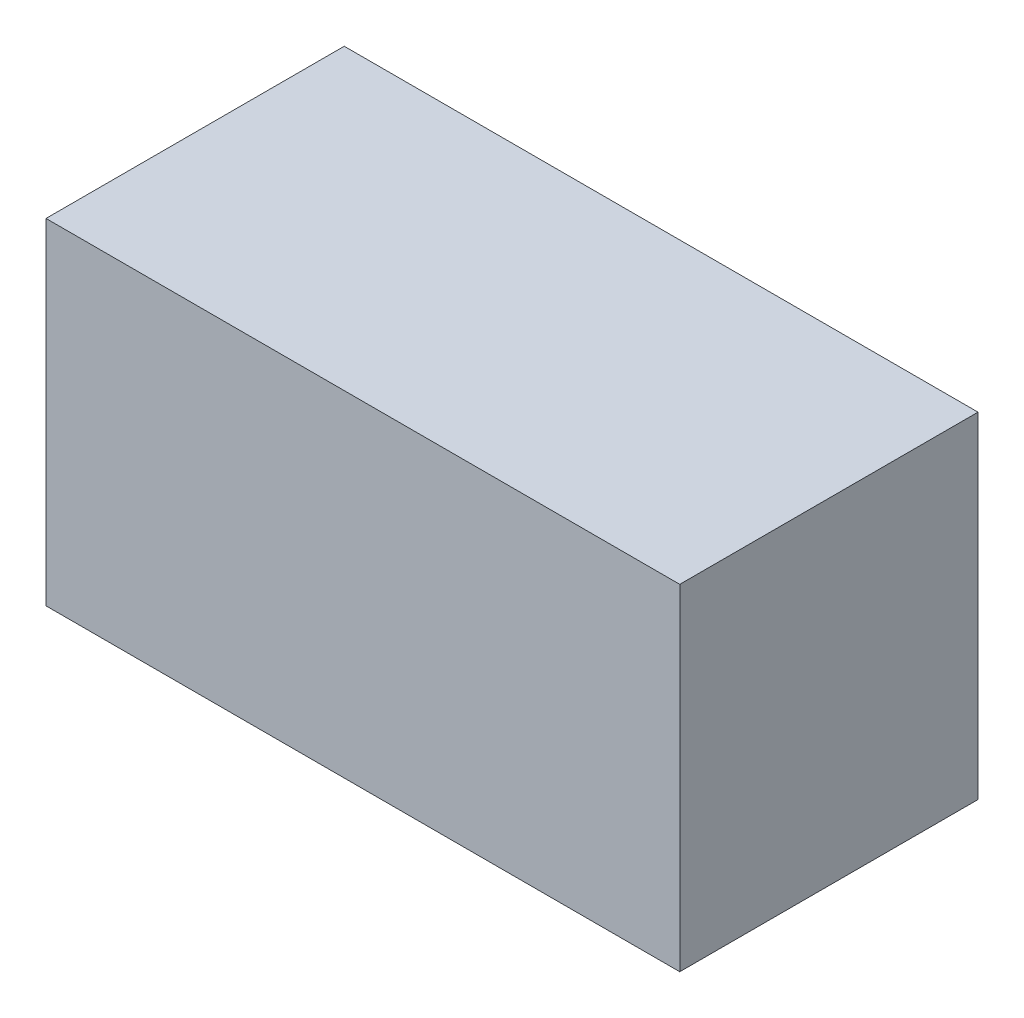
ISO-10303-21;
HEADER;
FILE_DESCRIPTION(('STEP AP214'),'2;1');
FILE_NAME('part.step','',(''),(''),'','','');
FILE_SCHEMA(('AUTOMOTIVE_DESIGN { 1 0 10303 214 1 1 1 1 }'));
ENDSEC;
DATA;
#1=APPLICATION_CONTEXT('core data for automotive mechanical design processes');
#2=APPLICATION_PROTOCOL_DEFINITION('international standard','automotive_design',2000,#1);
#3=PRODUCT_CONTEXT('',#1,'mechanical');
#4=PRODUCT('Part','Part','',(#3));
#5=PRODUCT_RELATED_PRODUCT_CATEGORY('part','',(#4));
#6=PRODUCT_DEFINITION_FORMATION('','',#4);
#7=PRODUCT_DEFINITION_CONTEXT('part definition',#1,'design');
#8=PRODUCT_DEFINITION('design','',#6,#7);
#9=PRODUCT_DEFINITION_SHAPE('','',#8);
#10=(LENGTH_UNIT() NAMED_UNIT(*) SI_UNIT(.MILLI.,.METRE.));
#11=(NAMED_UNIT(*) PLANE_ANGLE_UNIT() SI_UNIT($,.RADIAN.));
#12=(NAMED_UNIT(*) SI_UNIT($,.STERADIAN.) SOLID_ANGLE_UNIT());
#13=UNCERTAINTY_MEASURE_WITH_UNIT(LENGTH_MEASURE(1.E-05),#10,'distance_accuracy_value','');
#14=(GEOMETRIC_REPRESENTATION_CONTEXT(3) GLOBAL_UNCERTAINTY_ASSIGNED_CONTEXT((#13)) GLOBAL_UNIT_ASSIGNED_CONTEXT((#10,
#11,#12)) REPRESENTATION_CONTEXT('',''));
#15=CARTESIAN_POINT('',(0.,0.,0.));
#16=DIRECTION('',(0.,0.,1.));
#17=DIRECTION('',(1.,0.,0.));
#18=AXIS2_PLACEMENT_3D('',#15,#16,#17);
#19=CARTESIAN_POINT('',(8.49999999999999,4.5,4.));
#20=DIRECTION('',(-1.,0.,0.));
#21=DIRECTION('',(0.,-1.,0.));
#22=AXIS2_PLACEMENT_3D('',#19,#20,#21);
#23=PLANE('',#22);
#24=DIRECTION('',(0.,1.,0.));
#25=VECTOR('',#24,1.);
#26=CARTESIAN_POINT('',(8.49999999999999,4.5,-4.));
#27=LINE('',#26,#25);
#28=CARTESIAN_POINT('',(8.5,-4.5,-4.));
#29=VERTEX_POINT('',#28);
#30=CARTESIAN_POINT('',(8.49999999999999,4.5,-4.));
#31=VERTEX_POINT('',#30);
#32=EDGE_CURVE('E98',#29,#31,#27,.T.);
#33=ORIENTED_EDGE('',*,*,#32,.T.);
#34=DIRECTION('',(0.,0.,-1.));
#35=VECTOR('',#34,1.);
#36=CARTESIAN_POINT('',(8.49999999999999,4.5,4.));
#37=LINE('',#36,#35);
#38=CARTESIAN_POINT('',(8.49999999999999,4.5,4.));
#39=VERTEX_POINT('',#38);
#40=EDGE_CURVE('E11',#39,#31,#37,.T.);
#41=ORIENTED_EDGE('',*,*,#40,.F.);
#42=DIRECTION('',(0.,1.,0.));
#43=VECTOR('',#42,1.);
#44=CARTESIAN_POINT('',(8.49999999999999,4.5,4.));
#45=LINE('',#44,#43);
#46=CARTESIAN_POINT('',(8.5,-4.5,4.));
#47=VERTEX_POINT('',#46);
#48=EDGE_CURVE('E86',#47,#39,#45,.T.);
#49=ORIENTED_EDGE('',*,*,#48,.F.);
#50=DIRECTION('',(0.,0.,-1.));
#51=VECTOR('',#50,1.);
#52=CARTESIAN_POINT('',(8.5,-4.5,4.));
#53=LINE('',#52,#51);
#54=EDGE_CURVE('E94',#47,#29,#53,.T.);
#55=ORIENTED_EDGE('',*,*,#54,.T.);
#56=EDGE_LOOP('',(#33,#41,#49,#55));
#57=FACE_BOUND('',#56,.T.);
#58=ADVANCED_FACE('F35',(#57),#23,.F.);
#59=CARTESIAN_POINT('',(-8.50000000000001,4.5,4.));
#60=DIRECTION('',(0.,-1.,0.));
#61=DIRECTION('',(0.,0.,-1.));
#62=AXIS2_PLACEMENT_3D('',#59,#60,#61);
#63=PLANE('',#62);
#64=DIRECTION('',(-1.,0.,0.));
#65=VECTOR('',#64,1.);
#66=CARTESIAN_POINT('',(-8.50000000000001,4.5,-4.));
#67=LINE('',#66,#65);
#68=CARTESIAN_POINT('',(-8.50000000000001,4.5,-4.));
#69=VERTEX_POINT('',#68);
#70=EDGE_CURVE('E90',#31,#69,#67,.T.);
#71=ORIENTED_EDGE('',*,*,#70,.T.);
#72=DIRECTION('',(0.,0.,-1.));
#73=VECTOR('',#72,1.);
#74=CARTESIAN_POINT('',(-8.50000000000001,4.5,4.));
#75=LINE('',#74,#73);
#76=CARTESIAN_POINT('',(-8.50000000000001,4.5,4.));
#77=VERTEX_POINT('',#76);
#78=EDGE_CURVE('E43',#77,#69,#75,.T.);
#79=ORIENTED_EDGE('',*,*,#78,.F.);
#80=DIRECTION('',(-1.,0.,0.));
#81=VECTOR('',#80,1.);
#82=CARTESIAN_POINT('',(-8.50000000000001,4.5,4.));
#83=LINE('',#82,#81);
#84=EDGE_CURVE('E81',#39,#77,#83,.T.);
#85=ORIENTED_EDGE('',*,*,#84,.F.);
#86=ORIENTED_EDGE('',*,*,#40,.T.);
#87=EDGE_LOOP('',(#71,#79,#85,#86));
#88=FACE_BOUND('',#87,.T.);
#89=ADVANCED_FACE('F89',(#88),#63,.F.);
#90=CARTESIAN_POINT('',(-8.50000000000001,4.5,4.));
#91=DIRECTION('',(1.,0.,0.));
#92=DIRECTION('',(0.,1.,0.));
#93=AXIS2_PLACEMENT_3D('',#90,#91,#92);
#94=PLANE('',#93);
#95=DIRECTION('',(0.,-1.,0.));
#96=VECTOR('',#95,1.);
#97=CARTESIAN_POINT('',(-8.50000000000001,4.5,-4.));
#98=LINE('',#97,#96);
#99=CARTESIAN_POINT('',(-8.5,-4.5,-4.));
#100=VERTEX_POINT('',#99);
#101=EDGE_CURVE('E68',#69,#100,#98,.T.);
#102=ORIENTED_EDGE('',*,*,#101,.T.);
#103=DIRECTION('',(0.,0.,-1.));
#104=VECTOR('',#103,1.);
#105=CARTESIAN_POINT('',(-8.5,-4.5,4.));
#106=LINE('',#105,#104);
#107=CARTESIAN_POINT('',(-8.5,-4.5,4.));
#108=VERTEX_POINT('',#107);
#109=EDGE_CURVE('E91',#108,#100,#106,.T.);
#110=ORIENTED_EDGE('',*,*,#109,.F.);
#111=DIRECTION('',(0.,-1.,0.));
#112=VECTOR('',#111,1.);
#113=CARTESIAN_POINT('',(-8.50000000000001,4.5,4.));
#114=LINE('',#113,#112);
#115=EDGE_CURVE('E84',#77,#108,#114,.T.);
#116=ORIENTED_EDGE('',*,*,#115,.F.);
#117=ORIENTED_EDGE('',*,*,#78,.T.);
#118=EDGE_LOOP('',(#102,#110,#116,#117));
#119=FACE_BOUND('',#118,.T.);
#120=ADVANCED_FACE('F92',(#119),#94,.F.);
#121=CARTESIAN_POINT('',(-8.5,-4.5,4.));
#122=DIRECTION('',(0.,1.,0.));
#123=DIRECTION('',(0.,0.,1.));
#124=AXIS2_PLACEMENT_3D('',#121,#122,#123);
#125=PLANE('',#124);
#126=DIRECTION('',(1.,0.,0.));
#127=VECTOR('',#126,1.);
#128=CARTESIAN_POINT('',(-8.5,-4.5,-4.));
#129=LINE('',#128,#127);
#130=EDGE_CURVE('E74',#100,#29,#129,.T.);
#131=ORIENTED_EDGE('',*,*,#130,.T.);
#132=ORIENTED_EDGE('',*,*,#54,.F.);
#133=DIRECTION('',(1.,0.,0.));
#134=VECTOR('',#133,1.);
#135=CARTESIAN_POINT('',(-8.5,-4.5,4.));
#136=LINE('',#135,#134);
#137=EDGE_CURVE('E51',#108,#47,#136,.T.);
#138=ORIENTED_EDGE('',*,*,#137,.F.);
#139=ORIENTED_EDGE('',*,*,#109,.T.);
#140=EDGE_LOOP('',(#131,#132,#138,#139));
#141=FACE_BOUND('',#140,.T.);
#142=ADVANCED_FACE('F105',(#141),#125,.F.);
#143=CARTESIAN_POINT('',(0.,0.,4.));
#144=DIRECTION('',(0.,0.,1.));
#145=DIRECTION('',(1.,0.,0.));
#146=AXIS2_PLACEMENT_3D('',#143,#144,#145);
#147=PLANE('',#146);
#148=ORIENTED_EDGE('',*,*,#48,.T.);
#149=ORIENTED_EDGE('',*,*,#84,.T.);
#150=ORIENTED_EDGE('',*,*,#115,.T.);
#151=ORIENTED_EDGE('',*,*,#137,.T.);
#152=EDGE_LOOP('',(#148,#149,#150,#151));
#153=FACE_BOUND('',#152,.T.);
#154=ADVANCED_FACE('F82',(#153),#147,.T.);
#155=CARTESIAN_POINT('',(0.,0.,-4.));
#156=DIRECTION('',(0.,0.,1.));
#157=DIRECTION('',(1.,0.,0.));
#158=AXIS2_PLACEMENT_3D('',#155,#156,#157);
#159=PLANE('',#158);
#160=ORIENTED_EDGE('',*,*,#32,.F.);
#161=ORIENTED_EDGE('',*,*,#130,.F.);
#162=ORIENTED_EDGE('',*,*,#101,.F.);
#163=ORIENTED_EDGE('',*,*,#70,.F.);
#164=EDGE_LOOP('',(#160,#161,#162,#163));
#165=FACE_BOUND('',#164,.T.);
#166=ADVANCED_FACE('F108',(#165),#159,.F.);
#167=CLOSED_SHELL('',(#58,#89,#120,#142,#154,#166));
#168=MANIFOLD_SOLID_BREP('B2',#167);
#169=ADVANCED_BREP_SHAPE_REPRESENTATION('',(#18,#168),#14);
#170=SHAPE_DEFINITION_REPRESENTATION(#9,#169);
ENDSEC;
END-ISO-10303-21;
